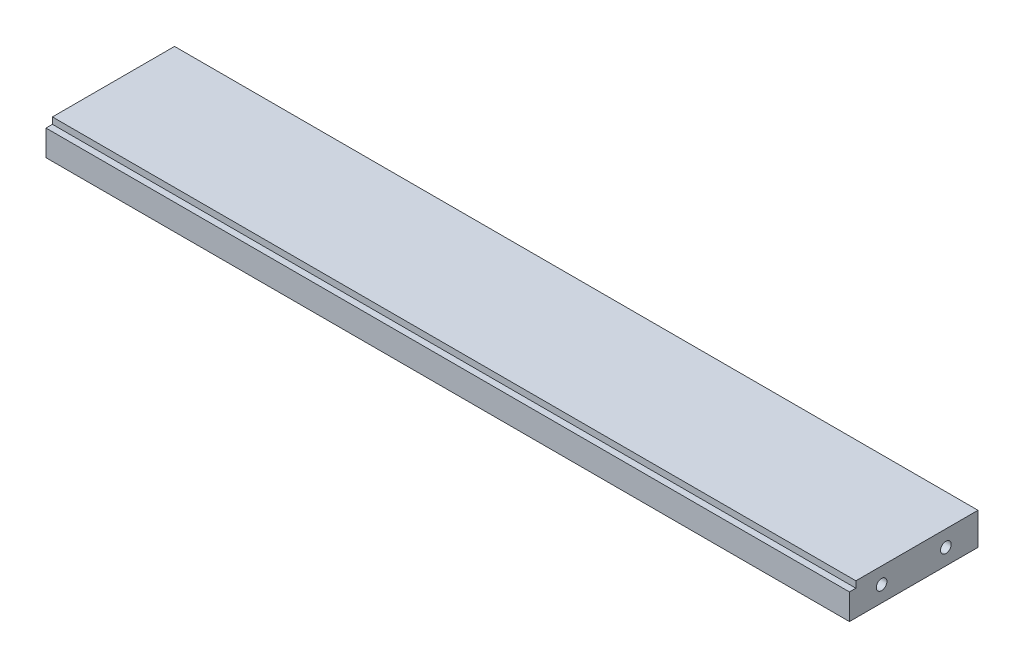
ISO-10303-21;
HEADER;
FILE_DESCRIPTION(('STEP AP214'),'2;1');
FILE_NAME('part.step','',(''),(''),'','','');
FILE_SCHEMA(('AUTOMOTIVE_DESIGN { 1 0 10303 214 1 1 1 1 }'));
ENDSEC;
DATA;
#1=APPLICATION_CONTEXT('core data for automotive mechanical design processes');
#2=APPLICATION_PROTOCOL_DEFINITION('international standard','automotive_design',2000,#1);
#3=PRODUCT_CONTEXT('',#1,'mechanical');
#4=PRODUCT('Part','Part','',(#3));
#5=PRODUCT_RELATED_PRODUCT_CATEGORY('part','',(#4));
#6=PRODUCT_DEFINITION_FORMATION('','',#4);
#7=PRODUCT_DEFINITION_CONTEXT('part definition',#1,'design');
#8=PRODUCT_DEFINITION('design','',#6,#7);
#9=PRODUCT_DEFINITION_SHAPE('','',#8);
#10=(LENGTH_UNIT() NAMED_UNIT(*) SI_UNIT(.MILLI.,.METRE.));
#11=(NAMED_UNIT(*) PLANE_ANGLE_UNIT() SI_UNIT($,.RADIAN.));
#12=(NAMED_UNIT(*) SI_UNIT($,.STERADIAN.) SOLID_ANGLE_UNIT());
#13=UNCERTAINTY_MEASURE_WITH_UNIT(LENGTH_MEASURE(1.E-05),#10,'distance_accuracy_value','');
#14=(GEOMETRIC_REPRESENTATION_CONTEXT(3) GLOBAL_UNCERTAINTY_ASSIGNED_CONTEXT((#13)) GLOBAL_UNIT_ASSIGNED_CONTEXT((#10,
#11,#12)) REPRESENTATION_CONTEXT('',''));
#15=CARTESIAN_POINT('',(0.,0.,0.));
#16=DIRECTION('',(0.,0.,1.));
#17=DIRECTION('',(1.,0.,0.));
#18=AXIS2_PLACEMENT_3D('',#15,#16,#17);
#19=CARTESIAN_POINT('',(125.,5.,20.));
#20=DIRECTION('',(-1.,0.,0.));
#21=DIRECTION('',(0.,0.,1.));
#22=AXIS2_PLACEMENT_3D('',#19,#20,#21);
#23=PLANE('',#22);
#24=CARTESIAN_POINT('',(125.,0.,-10.));
#25=DIRECTION('',(1.,0.,0.));
#26=DIRECTION('',(0.,0.,-1.));
#27=AXIS2_PLACEMENT_3D('',#24,#25,#26);
#28=CIRCLE('',#27,1.65);
#29=CARTESIAN_POINT('',(125.,0.,-11.65));
#30=VERTEX_POINT('',#29);
#31=EDGE_CURVE('E145',#30,#30,#28,.T.);
#32=ORIENTED_EDGE('',*,*,#31,.F.);
#33=EDGE_LOOP('',(#32));
#34=FACE_BOUND('',#33,.T.);
#35=CARTESIAN_POINT('',(125.,0.,10.));
#36=DIRECTION('',(1.,0.,0.));
#37=DIRECTION('',(0.,0.,-1.));
#38=AXIS2_PLACEMENT_3D('',#35,#36,#37);
#39=CIRCLE('',#38,1.65);
#40=CARTESIAN_POINT('',(125.,0.,8.35));
#41=VERTEX_POINT('',#40);
#42=EDGE_CURVE('E139',#41,#41,#39,.T.);
#43=ORIENTED_EDGE('',*,*,#42,.F.);
#44=EDGE_LOOP('',(#43));
#45=FACE_BOUND('',#44,.T.);
#46=DIRECTION('',(0.,0.,-1.));
#47=VECTOR('',#46,1.);
#48=CARTESIAN_POINT('',(125.,5.,20.));
#49=LINE('',#48,#47);
#50=CARTESIAN_POINT('',(125.,5.,18.));
#51=VERTEX_POINT('',#50);
#52=CARTESIAN_POINT('',(125.,5.,-20.));
#53=VERTEX_POINT('',#52);
#54=EDGE_CURVE('E101',#51,#53,#49,.T.);
#55=ORIENTED_EDGE('',*,*,#54,.F.);
#56=DIRECTION('',(0.,1.,0.));
#57=VECTOR('',#56,1.);
#58=CARTESIAN_POINT('',(125.,5.,18.));
#59=LINE('',#58,#57);
#60=CARTESIAN_POINT('',(125.,3.,18.));
#61=VERTEX_POINT('',#60);
#62=EDGE_CURVE('E51',#61,#51,#59,.T.);
#63=ORIENTED_EDGE('',*,*,#62,.F.);
#64=DIRECTION('',(0.,0.,-1.));
#65=VECTOR('',#64,1.);
#66=CARTESIAN_POINT('',(125.,3.,20.));
#67=LINE('',#66,#65);
#68=CARTESIAN_POINT('',(125.,3.,20.));
#69=VERTEX_POINT('',#68);
#70=EDGE_CURVE('E88',#69,#61,#67,.T.);
#71=ORIENTED_EDGE('',*,*,#70,.F.);
#72=DIRECTION('',(0.,-1.,0.));
#73=VECTOR('',#72,1.);
#74=CARTESIAN_POINT('',(125.,5.,20.));
#75=LINE('',#74,#73);
#76=CARTESIAN_POINT('',(125.,-5.,20.));
#77=VERTEX_POINT('',#76);
#78=EDGE_CURVE('E80',#69,#77,#75,.T.);
#79=ORIENTED_EDGE('',*,*,#78,.T.);
#80=DIRECTION('',(0.,0.,-1.));
#81=VECTOR('',#80,1.);
#82=CARTESIAN_POINT('',(125.,-5.,20.));
#83=LINE('',#82,#81);
#84=CARTESIAN_POINT('',(125.,-5.,-20.));
#85=VERTEX_POINT('',#84);
#86=EDGE_CURVE('E85',#77,#85,#83,.T.);
#87=ORIENTED_EDGE('',*,*,#86,.T.);
#88=DIRECTION('',(0.,-1.,0.));
#89=VECTOR('',#88,1.);
#90=CARTESIAN_POINT('',(125.,5.,-20.));
#91=LINE('',#90,#89);
#92=EDGE_CURVE('E11',#53,#85,#91,.T.);
#93=ORIENTED_EDGE('',*,*,#92,.F.);
#94=EDGE_LOOP('',(#55,#63,#71,#79,#87,#93));
#95=FACE_BOUND('',#94,.T.);
#96=ADVANCED_FACE('F37',(#34,#45,#95),#23,.F.);
#97=CARTESIAN_POINT('',(-125.,5.,-20.));
#98=DIRECTION('',(0.,0.,1.));
#99=DIRECTION('',(1.,0.,0.));
#100=AXIS2_PLACEMENT_3D('',#97,#98,#99);
#101=PLANE('',#100);
#102=CARTESIAN_POINT('',(75.,0.,-20.));
#103=DIRECTION('',(0.,0.,-1.));
#104=DIRECTION('',(-1.,0.,0.));
#105=AXIS2_PLACEMENT_3D('',#102,#103,#104);
#106=CIRCLE('',#105,1.64999999999998);
#107=CARTESIAN_POINT('',(73.35,0.,-20.));
#108=VERTEX_POINT('',#107);
#109=EDGE_CURVE('E169',#108,#108,#106,.T.);
#110=ORIENTED_EDGE('',*,*,#109,.F.);
#111=EDGE_LOOP('',(#110));
#112=FACE_BOUND('',#111,.T.);
#113=CARTESIAN_POINT('',(-75.,0.,-20.));
#114=DIRECTION('',(0.,0.,-1.));
#115=DIRECTION('',(-1.,0.,0.));
#116=AXIS2_PLACEMENT_3D('',#113,#114,#115);
#117=CIRCLE('',#116,1.64999999999998);
#118=CARTESIAN_POINT('',(-76.65,0.,-20.));
#119=VERTEX_POINT('',#118);
#120=EDGE_CURVE('E163',#119,#119,#117,.T.);
#121=ORIENTED_EDGE('',*,*,#120,.F.);
#122=EDGE_LOOP('',(#121));
#123=FACE_BOUND('',#122,.T.);
#124=DIRECTION('',(-1.,0.,0.));
#125=VECTOR('',#124,1.);
#126=CARTESIAN_POINT('',(-125.,-5.,-20.));
#127=LINE('',#126,#125);
#128=CARTESIAN_POINT('',(-125.,-5.,-20.));
#129=VERTEX_POINT('',#128);
#130=EDGE_CURVE('E105',#85,#129,#127,.T.);
#131=ORIENTED_EDGE('',*,*,#130,.T.);
#132=DIRECTION('',(0.,-1.,0.));
#133=VECTOR('',#132,1.);
#134=CARTESIAN_POINT('',(-125.,5.,-20.));
#135=LINE('',#134,#133);
#136=CARTESIAN_POINT('',(-125.,5.,-20.));
#137=VERTEX_POINT('',#136);
#138=EDGE_CURVE('E44',#137,#129,#135,.T.);
#139=ORIENTED_EDGE('',*,*,#138,.F.);
#140=DIRECTION('',(-1.,0.,0.));
#141=VECTOR('',#140,1.);
#142=CARTESIAN_POINT('',(-125.,5.,-20.));
#143=LINE('',#142,#141);
#144=EDGE_CURVE('E60',#53,#137,#143,.T.);
#145=ORIENTED_EDGE('',*,*,#144,.F.);
#146=ORIENTED_EDGE('',*,*,#92,.T.);
#147=EDGE_LOOP('',(#131,#139,#145,#146));
#148=FACE_BOUND('',#147,.T.);
#149=ADVANCED_FACE('F122',(#112,#123,#148),#101,.F.);
#150=CARTESIAN_POINT('',(-125.,5.,20.));
#151=DIRECTION('',(1.,0.,0.));
#152=DIRECTION('',(0.,0.,-1.));
#153=AXIS2_PLACEMENT_3D('',#150,#151,#152);
#154=PLANE('',#153);
#155=CARTESIAN_POINT('',(-125.,0.,-10.));
#156=DIRECTION('',(-1.,0.,0.));
#157=DIRECTION('',(0.,0.,1.));
#158=AXIS2_PLACEMENT_3D('',#155,#156,#157);
#159=CIRCLE('',#158,1.65);
#160=CARTESIAN_POINT('',(-125.,0.,-8.35));
#161=VERTEX_POINT('',#160);
#162=EDGE_CURVE('E157',#161,#161,#159,.T.);
#163=ORIENTED_EDGE('',*,*,#162,.F.);
#164=EDGE_LOOP('',(#163));
#165=FACE_BOUND('',#164,.T.);
#166=CARTESIAN_POINT('',(-125.,0.,10.));
#167=DIRECTION('',(-1.,0.,0.));
#168=DIRECTION('',(0.,0.,1.));
#169=AXIS2_PLACEMENT_3D('',#166,#167,#168);
#170=CIRCLE('',#169,1.65);
#171=CARTESIAN_POINT('',(-125.,0.,11.65));
#172=VERTEX_POINT('',#171);
#173=EDGE_CURVE('E151',#172,#172,#170,.T.);
#174=ORIENTED_EDGE('',*,*,#173,.F.);
#175=EDGE_LOOP('',(#174));
#176=FACE_BOUND('',#175,.T.);
#177=DIRECTION('',(0.,0.,-1.));
#178=VECTOR('',#177,1.);
#179=CARTESIAN_POINT('',(-125.,3.,20.));
#180=LINE('',#179,#178);
#181=CARTESIAN_POINT('',(-125.,3.,20.));
#182=VERTEX_POINT('',#181);
#183=CARTESIAN_POINT('',(-125.,3.,18.));
#184=VERTEX_POINT('',#183);
#185=EDGE_CURVE('E132',#182,#184,#180,.T.);
#186=ORIENTED_EDGE('',*,*,#185,.T.);
#187=DIRECTION('',(0.,1.,0.));
#188=VECTOR('',#187,1.);
#189=CARTESIAN_POINT('',(-125.,5.,18.));
#190=LINE('',#189,#188);
#191=CARTESIAN_POINT('',(-125.,5.,18.));
#192=VERTEX_POINT('',#191);
#193=EDGE_CURVE('E129',#184,#192,#190,.T.);
#194=ORIENTED_EDGE('',*,*,#193,.T.);
#195=DIRECTION('',(0.,0.,1.));
#196=VECTOR('',#195,1.);
#197=CARTESIAN_POINT('',(-125.,5.,20.));
#198=LINE('',#197,#196);
#199=EDGE_CURVE('E92',#137,#192,#198,.T.);
#200=ORIENTED_EDGE('',*,*,#199,.F.);
#201=ORIENTED_EDGE('',*,*,#138,.T.);
#202=DIRECTION('',(0.,0.,1.));
#203=VECTOR('',#202,1.);
#204=CARTESIAN_POINT('',(-125.,-5.,20.));
#205=LINE('',#204,#203);
#206=CARTESIAN_POINT('',(-125.,-5.,20.));
#207=VERTEX_POINT('',#206);
#208=EDGE_CURVE('E102',#129,#207,#205,.T.);
#209=ORIENTED_EDGE('',*,*,#208,.T.);
#210=DIRECTION('',(0.,-1.,0.));
#211=VECTOR('',#210,1.);
#212=CARTESIAN_POINT('',(-125.,5.,20.));
#213=LINE('',#212,#211);
#214=EDGE_CURVE('E91',#182,#207,#213,.T.);
#215=ORIENTED_EDGE('',*,*,#214,.F.);
#216=EDGE_LOOP('',(#186,#194,#200,#201,#209,#215));
#217=FACE_BOUND('',#216,.T.);
#218=ADVANCED_FACE('F119',(#165,#176,#217),#154,.F.);
#219=CARTESIAN_POINT('',(-125.,5.,20.));
#220=DIRECTION('',(0.,0.,-1.));
#221=DIRECTION('',(-1.,0.,0.));
#222=AXIS2_PLACEMENT_3D('',#219,#220,#221);
#223=PLANE('',#222);
#224=ORIENTED_EDGE('',*,*,#78,.F.);
#225=DIRECTION('',(1.,0.,0.));
#226=VECTOR('',#225,1.);
#227=CARTESIAN_POINT('',(-125.,3.,20.));
#228=LINE('',#227,#226);
#229=EDGE_CURVE('E126',#182,#69,#228,.T.);
#230=ORIENTED_EDGE('',*,*,#229,.F.);
#231=ORIENTED_EDGE('',*,*,#214,.T.);
#232=DIRECTION('',(1.,0.,0.));
#233=VECTOR('',#232,1.);
#234=CARTESIAN_POINT('',(-125.,-5.,20.));
#235=LINE('',#234,#233);
#236=EDGE_CURVE('E95',#207,#77,#235,.T.);
#237=ORIENTED_EDGE('',*,*,#236,.T.);
#238=EDGE_LOOP('',(#224,#230,#231,#237));
#239=FACE_BOUND('',#238,.T.);
#240=ADVANCED_FACE('F96',(#239),#223,.F.);
#241=CARTESIAN_POINT('',(0.,5.,0.));
#242=DIRECTION('',(0.,-1.,0.));
#243=DIRECTION('',(0.,0.,-1.));
#244=AXIS2_PLACEMENT_3D('',#241,#242,#243);
#245=PLANE('',#244);
#246=ORIENTED_EDGE('',*,*,#199,.T.);
#247=DIRECTION('',(1.,0.,0.));
#248=VECTOR('',#247,1.);
#249=CARTESIAN_POINT('',(-125.,5.,18.));
#250=LINE('',#249,#248);
#251=EDGE_CURVE('E106',#192,#51,#250,.T.);
#252=ORIENTED_EDGE('',*,*,#251,.T.);
#253=ORIENTED_EDGE('',*,*,#54,.T.);
#254=ORIENTED_EDGE('',*,*,#144,.T.);
#255=EDGE_LOOP('',(#246,#252,#253,#254));
#256=FACE_BOUND('',#255,.T.);
#257=ADVANCED_FACE('F228',(#256),#245,.F.);
#258=CARTESIAN_POINT('',(0.,-5.,0.));
#259=DIRECTION('',(0.,-1.,0.));
#260=DIRECTION('',(0.,0.,-1.));
#261=AXIS2_PLACEMENT_3D('',#258,#259,#260);
#262=PLANE('',#261);
#263=ORIENTED_EDGE('',*,*,#86,.F.);
#264=ORIENTED_EDGE('',*,*,#236,.F.);
#265=ORIENTED_EDGE('',*,*,#208,.F.);
#266=ORIENTED_EDGE('',*,*,#130,.F.);
#267=EDGE_LOOP('',(#263,#264,#265,#266));
#268=FACE_BOUND('',#267,.T.);
#269=ADVANCED_FACE('F104',(#268),#262,.T.);
#270=CARTESIAN_POINT('',(-125.,5.,18.));
#271=DIRECTION('',(0.,0.,-1.));
#272=DIRECTION('',(-1.,0.,0.));
#273=AXIS2_PLACEMENT_3D('',#270,#271,#272);
#274=PLANE('',#273);
#275=ORIENTED_EDGE('',*,*,#251,.F.);
#276=ORIENTED_EDGE('',*,*,#193,.F.);
#277=DIRECTION('',(1.,0.,0.));
#278=VECTOR('',#277,1.);
#279=CARTESIAN_POINT('',(-125.,3.,18.));
#280=LINE('',#279,#278);
#281=EDGE_CURVE('E109',#184,#61,#280,.T.);
#282=ORIENTED_EDGE('',*,*,#281,.T.);
#283=ORIENTED_EDGE('',*,*,#62,.T.);
#284=EDGE_LOOP('',(#275,#276,#282,#283));
#285=FACE_BOUND('',#284,.T.);
#286=ADVANCED_FACE('F222',(#285),#274,.F.);
#287=CARTESIAN_POINT('',(-125.,3.,20.));
#288=DIRECTION('',(0.,-1.,0.));
#289=DIRECTION('',(0.,0.,-1.));
#290=AXIS2_PLACEMENT_3D('',#287,#288,#289);
#291=PLANE('',#290);
#292=ORIENTED_EDGE('',*,*,#281,.F.);
#293=ORIENTED_EDGE('',*,*,#185,.F.);
#294=ORIENTED_EDGE('',*,*,#229,.T.);
#295=ORIENTED_EDGE('',*,*,#70,.T.);
#296=EDGE_LOOP('',(#292,#293,#294,#295));
#297=FACE_BOUND('',#296,.T.);
#298=ADVANCED_FACE('F216',(#297),#291,.F.);
#299=CARTESIAN_POINT('',(111.,0.,10.));
#300=DIRECTION('',(1.,0.,0.));
#301=DIRECTION('',(0.,0.,-1.));
#302=AXIS2_PLACEMENT_3D('',#299,#300,#301);
#303=CONICAL_SURFACE('',#302,1.65,1.02974425867665);
#304=CARTESIAN_POINT('',(110.008579978605,0.,10.));
#305=VERTEX_POINT('',#304);
#306=VERTEX_LOOP('',#305);
#307=FACE_BOUND('',#306,.T.);
#308=CARTESIAN_POINT('',(111.,0.,10.));
#309=DIRECTION('',(1.,0.,0.));
#310=DIRECTION('',(0.,0.,-1.));
#311=AXIS2_PLACEMENT_3D('',#308,#309,#310);
#312=CIRCLE('',#311,1.65);
#313=CARTESIAN_POINT('',(111.,0.,8.35));
#314=VERTEX_POINT('',#313);
#315=EDGE_CURVE('E136',#314,#314,#312,.T.);
#316=ORIENTED_EDGE('',*,*,#315,.T.);
#317=EDGE_LOOP('',(#316));
#318=FACE_BOUND('',#317,.T.);
#319=ADVANCED_FACE('F206',(#307,#318),#303,.F.);
#320=CARTESIAN_POINT('',(125.,0.,10.));
#321=DIRECTION('',(1.,0.,0.));
#322=DIRECTION('',(0.,0.,-1.));
#323=AXIS2_PLACEMENT_3D('',#320,#321,#322);
#324=CYLINDRICAL_SURFACE('',#323,1.65);
#325=ORIENTED_EDGE('',*,*,#315,.F.);
#326=EDGE_LOOP('',(#325));
#327=FACE_BOUND('',#326,.T.);
#328=ORIENTED_EDGE('',*,*,#42,.T.);
#329=EDGE_LOOP('',(#328));
#330=FACE_BOUND('',#329,.T.);
#331=ADVANCED_FACE('F203',(#327,#330),#324,.F.);
#332=CARTESIAN_POINT('',(111.,0.,-10.));
#333=DIRECTION('',(1.,0.,0.));
#334=DIRECTION('',(0.,0.,-1.));
#335=AXIS2_PLACEMENT_3D('',#332,#333,#334);
#336=CONICAL_SURFACE('',#335,1.65,1.02974425867665);
#337=CARTESIAN_POINT('',(110.008579978605,0.,-10.));
#338=VERTEX_POINT('',#337);
#339=VERTEX_LOOP('',#338);
#340=FACE_BOUND('',#339,.T.);
#341=CARTESIAN_POINT('',(111.,0.,-10.));
#342=DIRECTION('',(1.,0.,0.));
#343=DIRECTION('',(0.,0.,-1.));
#344=AXIS2_PLACEMENT_3D('',#341,#342,#343);
#345=CIRCLE('',#344,1.65);
#346=CARTESIAN_POINT('',(111.,0.,-11.65));
#347=VERTEX_POINT('',#346);
#348=EDGE_CURVE('E142',#347,#347,#345,.T.);
#349=ORIENTED_EDGE('',*,*,#348,.T.);
#350=EDGE_LOOP('',(#349));
#351=FACE_BOUND('',#350,.T.);
#352=ADVANCED_FACE('F205',(#340,#351),#336,.F.);
#353=CARTESIAN_POINT('',(125.,0.,-10.));
#354=DIRECTION('',(1.,0.,0.));
#355=DIRECTION('',(0.,0.,-1.));
#356=AXIS2_PLACEMENT_3D('',#353,#354,#355);
#357=CYLINDRICAL_SURFACE('',#356,1.65);
#358=ORIENTED_EDGE('',*,*,#348,.F.);
#359=EDGE_LOOP('',(#358));
#360=FACE_BOUND('',#359,.T.);
#361=ORIENTED_EDGE('',*,*,#31,.T.);
#362=EDGE_LOOP('',(#361));
#363=FACE_BOUND('',#362,.T.);
#364=ADVANCED_FACE('F213',(#360,#363),#357,.F.);
#365=CARTESIAN_POINT('',(-111.,0.,10.));
#366=DIRECTION('',(-1.,0.,0.));
#367=DIRECTION('',(0.,0.,1.));
#368=AXIS2_PLACEMENT_3D('',#365,#366,#367);
#369=CONICAL_SURFACE('',#368,1.65,1.02974425867665);
#370=CARTESIAN_POINT('',(-110.008579978605,0.,10.));
#371=VERTEX_POINT('',#370);
#372=VERTEX_LOOP('',#371);
#373=FACE_BOUND('',#372,.T.);
#374=CARTESIAN_POINT('',(-111.,0.,10.));
#375=DIRECTION('',(-1.,0.,0.));
#376=DIRECTION('',(0.,0.,1.));
#377=AXIS2_PLACEMENT_3D('',#374,#375,#376);
#378=CIRCLE('',#377,1.65);
#379=CARTESIAN_POINT('',(-111.,0.,11.65));
#380=VERTEX_POINT('',#379);
#381=EDGE_CURVE('E148',#380,#380,#378,.T.);
#382=ORIENTED_EDGE('',*,*,#381,.T.);
#383=EDGE_LOOP('',(#382));
#384=FACE_BOUND('',#383,.T.);
#385=ADVANCED_FACE('F246',(#373,#384),#369,.F.);
#386=CARTESIAN_POINT('',(-125.,0.,10.));
#387=DIRECTION('',(-1.,0.,0.));
#388=DIRECTION('',(0.,0.,1.));
#389=AXIS2_PLACEMENT_3D('',#386,#387,#388);
#390=CYLINDRICAL_SURFACE('',#389,1.65);
#391=ORIENTED_EDGE('',*,*,#381,.F.);
#392=EDGE_LOOP('',(#391));
#393=FACE_BOUND('',#392,.T.);
#394=ORIENTED_EDGE('',*,*,#173,.T.);
#395=EDGE_LOOP('',(#394));
#396=FACE_BOUND('',#395,.T.);
#397=ADVANCED_FACE('F243',(#393,#396),#390,.F.);
#398=CARTESIAN_POINT('',(-111.,0.,-10.));
#399=DIRECTION('',(-1.,0.,0.));
#400=DIRECTION('',(0.,0.,1.));
#401=AXIS2_PLACEMENT_3D('',#398,#399,#400);
#402=CONICAL_SURFACE('',#401,1.65,1.02974425867665);
#403=CARTESIAN_POINT('',(-110.008579978605,0.,-10.));
#404=VERTEX_POINT('',#403);
#405=VERTEX_LOOP('',#404);
#406=FACE_BOUND('',#405,.T.);
#407=CARTESIAN_POINT('',(-111.,0.,-10.));
#408=DIRECTION('',(-1.,0.,0.));
#409=DIRECTION('',(0.,0.,1.));
#410=AXIS2_PLACEMENT_3D('',#407,#408,#409);
#411=CIRCLE('',#410,1.65);
#412=CARTESIAN_POINT('',(-111.,0.,-8.35));
#413=VERTEX_POINT('',#412);
#414=EDGE_CURVE('E154',#413,#413,#411,.T.);
#415=ORIENTED_EDGE('',*,*,#414,.T.);
#416=EDGE_LOOP('',(#415));
#417=FACE_BOUND('',#416,.T.);
#418=ADVANCED_FACE('F245',(#406,#417),#402,.F.);
#419=CARTESIAN_POINT('',(-125.,0.,-10.));
#420=DIRECTION('',(-1.,0.,0.));
#421=DIRECTION('',(0.,0.,1.));
#422=AXIS2_PLACEMENT_3D('',#419,#420,#421);
#423=CYLINDRICAL_SURFACE('',#422,1.65);
#424=ORIENTED_EDGE('',*,*,#414,.F.);
#425=EDGE_LOOP('',(#424));
#426=FACE_BOUND('',#425,.T.);
#427=ORIENTED_EDGE('',*,*,#162,.T.);
#428=EDGE_LOOP('',(#427));
#429=FACE_BOUND('',#428,.T.);
#430=ADVANCED_FACE('F191',(#426,#429),#423,.F.);
#431=CARTESIAN_POINT('',(-75.,0.,-6.));
#432=DIRECTION('',(0.,0.,-1.));
#433=DIRECTION('',(-1.,0.,0.));
#434=AXIS2_PLACEMENT_3D('',#431,#432,#433);
#435=CONICAL_SURFACE('',#434,1.65,1.02974425867665);
#436=CARTESIAN_POINT('',(-75.,0.,-5.00857997860452));
#437=VERTEX_POINT('',#436);
#438=VERTEX_LOOP('',#437);
#439=FACE_BOUND('',#438,.T.);
#440=CARTESIAN_POINT('',(-75.,0.,-6.));
#441=DIRECTION('',(0.,0.,-1.));
#442=DIRECTION('',(-1.,0.,0.));
#443=AXIS2_PLACEMENT_3D('',#440,#441,#442);
#444=CIRCLE('',#443,1.65);
#445=CARTESIAN_POINT('',(-76.65,0.,-6.));
#446=VERTEX_POINT('',#445);
#447=EDGE_CURVE('E160',#446,#446,#444,.T.);
#448=ORIENTED_EDGE('',*,*,#447,.T.);
#449=EDGE_LOOP('',(#448));
#450=FACE_BOUND('',#449,.T.);
#451=ADVANCED_FACE('F182',(#439,#450),#435,.F.);
#452=CARTESIAN_POINT('',(-75.,0.,-20.));
#453=DIRECTION('',(0.,0.,-1.));
#454=DIRECTION('',(-1.,0.,0.));
#455=AXIS2_PLACEMENT_3D('',#452,#453,#454);
#456=CYLINDRICAL_SURFACE('',#455,1.64999999999999);
#457=ORIENTED_EDGE('',*,*,#447,.F.);
#458=EDGE_LOOP('',(#457));
#459=FACE_BOUND('',#458,.T.);
#460=ORIENTED_EDGE('',*,*,#120,.T.);
#461=EDGE_LOOP('',(#460));
#462=FACE_BOUND('',#461,.T.);
#463=ADVANCED_FACE('F179',(#459,#462),#456,.F.);
#464=CARTESIAN_POINT('',(75.,0.,-6.));
#465=DIRECTION('',(0.,0.,-1.));
#466=DIRECTION('',(-1.,0.,0.));
#467=AXIS2_PLACEMENT_3D('',#464,#465,#466);
#468=CONICAL_SURFACE('',#467,1.65,1.02974425867665);
#469=CARTESIAN_POINT('',(75.,0.,-5.00857997860452));
#470=VERTEX_POINT('',#469);
#471=VERTEX_LOOP('',#470);
#472=FACE_BOUND('',#471,.T.);
#473=CARTESIAN_POINT('',(75.,0.,-6.));
#474=DIRECTION('',(0.,0.,-1.));
#475=DIRECTION('',(-1.,0.,0.));
#476=AXIS2_PLACEMENT_3D('',#473,#474,#475);
#477=CIRCLE('',#476,1.65);
#478=CARTESIAN_POINT('',(73.35,0.,-6.));
#479=VERTEX_POINT('',#478);
#480=EDGE_CURVE('E166',#479,#479,#477,.T.);
#481=ORIENTED_EDGE('',*,*,#480,.T.);
#482=EDGE_LOOP('',(#481));
#483=FACE_BOUND('',#482,.T.);
#484=ADVANCED_FACE('F181',(#472,#483),#468,.F.);
#485=CARTESIAN_POINT('',(75.,0.,-20.));
#486=DIRECTION('',(0.,0.,-1.));
#487=DIRECTION('',(-1.,0.,0.));
#488=AXIS2_PLACEMENT_3D('',#485,#486,#487);
#489=CYLINDRICAL_SURFACE('',#488,1.64999999999999);
#490=ORIENTED_EDGE('',*,*,#480,.F.);
#491=EDGE_LOOP('',(#490));
#492=FACE_BOUND('',#491,.T.);
#493=ORIENTED_EDGE('',*,*,#109,.T.);
#494=EDGE_LOOP('',(#493));
#495=FACE_BOUND('',#494,.T.);
#496=ADVANCED_FACE('F173',(#492,#495),#489,.F.);
#497=CLOSED_SHELL('',(#96,#149,#218,#240,#257,#269,#286,#298,#319,#331,#352,#364,#385,#397,#418,
#430,#451,#463,#484,#496));
#498=MANIFOLD_SOLID_BREP('B2',#497);
#499=ADVANCED_BREP_SHAPE_REPRESENTATION('',(#18,#498),#14);
#500=SHAPE_DEFINITION_REPRESENTATION(#9,#499);
ENDSEC;
END-ISO-10303-21;
